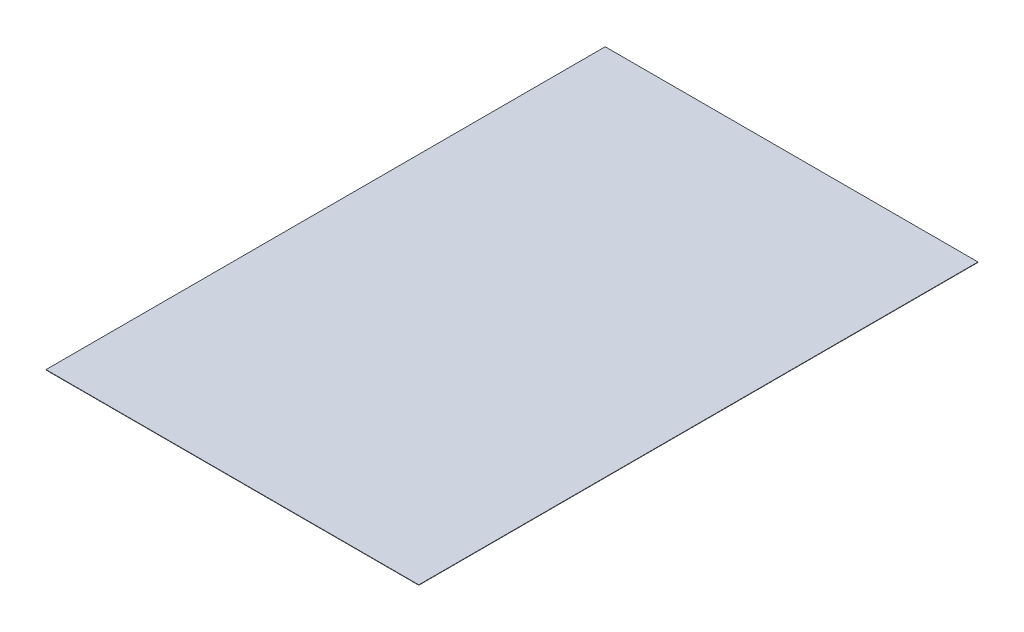
ISO-10303-21;
HEADER;
FILE_DESCRIPTION(('STEP AP214'),'2;1');
FILE_NAME('part.step','',(''),(''),'','','');
FILE_SCHEMA(('AUTOMOTIVE_DESIGN { 1 0 10303 214 1 1 1 1 }'));
ENDSEC;
DATA;
#1=APPLICATION_CONTEXT('core data for automotive mechanical design processes');
#2=APPLICATION_PROTOCOL_DEFINITION('international standard','automotive_design',2000,#1);
#3=PRODUCT_CONTEXT('',#1,'mechanical');
#4=PRODUCT('Part','Part','',(#3));
#5=PRODUCT_RELATED_PRODUCT_CATEGORY('part','',(#4));
#6=PRODUCT_DEFINITION_FORMATION('','',#4);
#7=PRODUCT_DEFINITION_CONTEXT('part definition',#1,'design');
#8=PRODUCT_DEFINITION('design','',#6,#7);
#9=PRODUCT_DEFINITION_SHAPE('','',#8);
#10=(LENGTH_UNIT() NAMED_UNIT(*) SI_UNIT(.MILLI.,.METRE.));
#11=(NAMED_UNIT(*) PLANE_ANGLE_UNIT() SI_UNIT($,.RADIAN.));
#12=(NAMED_UNIT(*) SI_UNIT($,.STERADIAN.) SOLID_ANGLE_UNIT());
#13=UNCERTAINTY_MEASURE_WITH_UNIT(LENGTH_MEASURE(1.E-05),#10,'distance_accuracy_value','');
#14=(GEOMETRIC_REPRESENTATION_CONTEXT(3) GLOBAL_UNCERTAINTY_ASSIGNED_CONTEXT((#13)) GLOBAL_UNIT_ASSIGNED_CONTEXT((#10,
#11,#12)) REPRESENTATION_CONTEXT('',''));
#15=CARTESIAN_POINT('',(0.,0.,0.));
#16=DIRECTION('',(0.,0.,1.));
#17=DIRECTION('',(1.,0.,0.));
#18=AXIS2_PLACEMENT_3D('',#15,#16,#17);
#19=CARTESIAN_POINT('',(3048.,6.,4572.));
#20=DIRECTION('',(-1.,0.,0.));
#21=DIRECTION('',(0.,0.,1.));
#22=AXIS2_PLACEMENT_3D('',#19,#20,#21);
#23=PLANE('',#22);
#24=DIRECTION('',(0.,0.,-1.));
#25=VECTOR('',#24,1.);
#26=CARTESIAN_POINT('',(3048.,0.,4572.));
#27=LINE('',#26,#25);
#28=CARTESIAN_POINT('',(3048.,0.,4572.));
#29=VERTEX_POINT('',#28);
#30=CARTESIAN_POINT('',(3048.,0.,-4572.));
#31=VERTEX_POINT('',#30);
#32=EDGE_CURVE('E102',#29,#31,#27,.T.);
#33=ORIENTED_EDGE('',*,*,#32,.T.);
#34=DIRECTION('',(0.,-1.,0.));
#35=VECTOR('',#34,1.);
#36=CARTESIAN_POINT('',(3048.,6.,-4572.));
#37=LINE('',#36,#35);
#38=CARTESIAN_POINT('',(3048.,6.,-4572.));
#39=VERTEX_POINT('',#38);
#40=EDGE_CURVE('E11',#39,#31,#37,.T.);
#41=ORIENTED_EDGE('',*,*,#40,.F.);
#42=DIRECTION('',(0.,0.,-1.));
#43=VECTOR('',#42,1.);
#44=CARTESIAN_POINT('',(3048.,6.,4572.));
#45=LINE('',#44,#43);
#46=CARTESIAN_POINT('',(3048.,6.,4572.));
#47=VERTEX_POINT('',#46);
#48=EDGE_CURVE('E90',#47,#39,#45,.T.);
#49=ORIENTED_EDGE('',*,*,#48,.F.);
#50=DIRECTION('',(0.,-1.,0.));
#51=VECTOR('',#50,1.);
#52=CARTESIAN_POINT('',(3048.,6.,4572.));
#53=LINE('',#52,#51);
#54=EDGE_CURVE('E98',#47,#29,#53,.T.);
#55=ORIENTED_EDGE('',*,*,#54,.T.);
#56=EDGE_LOOP('',(#33,#41,#49,#55));
#57=FACE_BOUND('',#56,.T.);
#58=ADVANCED_FACE('F39',(#57),#23,.F.);
#59=CARTESIAN_POINT('',(-3048.,6.,-4572.));
#60=DIRECTION('',(0.,0.,1.));
#61=DIRECTION('',(1.,0.,0.));
#62=AXIS2_PLACEMENT_3D('',#59,#60,#61);
#63=PLANE('',#62);
#64=DIRECTION('',(-1.,0.,0.));
#65=VECTOR('',#64,1.);
#66=CARTESIAN_POINT('',(-3048.,0.,-4572.));
#67=LINE('',#66,#65);
#68=CARTESIAN_POINT('',(-3048.,0.,-4572.));
#69=VERTEX_POINT('',#68);
#70=EDGE_CURVE('E94',#31,#69,#67,.T.);
#71=ORIENTED_EDGE('',*,*,#70,.T.);
#72=DIRECTION('',(0.,-1.,0.));
#73=VECTOR('',#72,1.);
#74=CARTESIAN_POINT('',(-3048.,6.,-4572.));
#75=LINE('',#74,#73);
#76=CARTESIAN_POINT('',(-3048.,6.,-4572.));
#77=VERTEX_POINT('',#76);
#78=EDGE_CURVE('E47',#77,#69,#75,.T.);
#79=ORIENTED_EDGE('',*,*,#78,.F.);
#80=DIRECTION('',(-1.,0.,0.));
#81=VECTOR('',#80,1.);
#82=CARTESIAN_POINT('',(-3048.,6.,-4572.));
#83=LINE('',#82,#81);
#84=EDGE_CURVE('E85',#39,#77,#83,.T.);
#85=ORIENTED_EDGE('',*,*,#84,.F.);
#86=ORIENTED_EDGE('',*,*,#40,.T.);
#87=EDGE_LOOP('',(#71,#79,#85,#86));
#88=FACE_BOUND('',#87,.T.);
#89=ADVANCED_FACE('F93',(#88),#63,.F.);
#90=CARTESIAN_POINT('',(-3048.,6.,4572.));
#91=DIRECTION('',(1.,0.,0.));
#92=DIRECTION('',(0.,0.,-1.));
#93=AXIS2_PLACEMENT_3D('',#90,#91,#92);
#94=PLANE('',#93);
#95=DIRECTION('',(0.,0.,1.));
#96=VECTOR('',#95,1.);
#97=CARTESIAN_POINT('',(-3048.,0.,4572.));
#98=LINE('',#97,#96);
#99=CARTESIAN_POINT('',(-3048.,0.,4572.));
#100=VERTEX_POINT('',#99);
#101=EDGE_CURVE('E72',#69,#100,#98,.T.);
#102=ORIENTED_EDGE('',*,*,#101,.T.);
#103=DIRECTION('',(0.,-1.,0.));
#104=VECTOR('',#103,1.);
#105=CARTESIAN_POINT('',(-3048.,6.,4572.));
#106=LINE('',#105,#104);
#107=CARTESIAN_POINT('',(-3048.,6.,4572.));
#108=VERTEX_POINT('',#107);
#109=EDGE_CURVE('E95',#108,#100,#106,.T.);
#110=ORIENTED_EDGE('',*,*,#109,.F.);
#111=DIRECTION('',(0.,0.,1.));
#112=VECTOR('',#111,1.);
#113=CARTESIAN_POINT('',(-3048.,6.,4572.));
#114=LINE('',#113,#112);
#115=EDGE_CURVE('E88',#77,#108,#114,.T.);
#116=ORIENTED_EDGE('',*,*,#115,.F.);
#117=ORIENTED_EDGE('',*,*,#78,.T.);
#118=EDGE_LOOP('',(#102,#110,#116,#117));
#119=FACE_BOUND('',#118,.T.);
#120=ADVANCED_FACE('F96',(#119),#94,.F.);
#121=CARTESIAN_POINT('',(-3048.,6.,4572.));
#122=DIRECTION('',(0.,0.,-1.));
#123=DIRECTION('',(-1.,0.,0.));
#124=AXIS2_PLACEMENT_3D('',#121,#122,#123);
#125=PLANE('',#124);
#126=DIRECTION('',(1.,0.,0.));
#127=VECTOR('',#126,1.);
#128=CARTESIAN_POINT('',(-3048.,0.,4572.));
#129=LINE('',#128,#127);
#130=EDGE_CURVE('E78',#100,#29,#129,.T.);
#131=ORIENTED_EDGE('',*,*,#130,.T.);
#132=ORIENTED_EDGE('',*,*,#54,.F.);
#133=DIRECTION('',(1.,0.,0.));
#134=VECTOR('',#133,1.);
#135=CARTESIAN_POINT('',(-3048.,6.,4572.));
#136=LINE('',#135,#134);
#137=EDGE_CURVE('E55',#108,#47,#136,.T.);
#138=ORIENTED_EDGE('',*,*,#137,.F.);
#139=ORIENTED_EDGE('',*,*,#109,.T.);
#140=EDGE_LOOP('',(#131,#132,#138,#139));
#141=FACE_BOUND('',#140,.T.);
#142=ADVANCED_FACE('F109',(#141),#125,.F.);
#143=CARTESIAN_POINT('',(0.,6.,0.));
#144=DIRECTION('',(0.,-1.,0.));
#145=DIRECTION('',(0.,0.,-1.));
#146=AXIS2_PLACEMENT_3D('',#143,#144,#145);
#147=PLANE('',#146);
#148=ORIENTED_EDGE('',*,*,#48,.T.);
#149=ORIENTED_EDGE('',*,*,#84,.T.);
#150=ORIENTED_EDGE('',*,*,#115,.T.);
#151=ORIENTED_EDGE('',*,*,#137,.T.);
#152=EDGE_LOOP('',(#148,#149,#150,#151));
#153=FACE_BOUND('',#152,.T.);
#154=ADVANCED_FACE('F86',(#153),#147,.F.);
#155=CARTESIAN_POINT('',(0.,0.,0.));
#156=DIRECTION('',(0.,-1.,0.));
#157=DIRECTION('',(0.,0.,-1.));
#158=AXIS2_PLACEMENT_3D('',#155,#156,#157);
#159=PLANE('',#158);
#160=ORIENTED_EDGE('',*,*,#32,.F.);
#161=ORIENTED_EDGE('',*,*,#130,.F.);
#162=ORIENTED_EDGE('',*,*,#101,.F.);
#163=ORIENTED_EDGE('',*,*,#70,.F.);
#164=EDGE_LOOP('',(#160,#161,#162,#163));
#165=FACE_BOUND('',#164,.T.);
#166=ADVANCED_FACE('F112',(#165),#159,.T.);
#167=CLOSED_SHELL('',(#58,#89,#120,#142,#154,#166));
#168=MANIFOLD_SOLID_BREP('B2',#167);
#169=ADVANCED_BREP_SHAPE_REPRESENTATION('',(#18,#168),#14);
#170=SHAPE_DEFINITION_REPRESENTATION(#9,#169);
ENDSEC;
END-ISO-10303-21;
